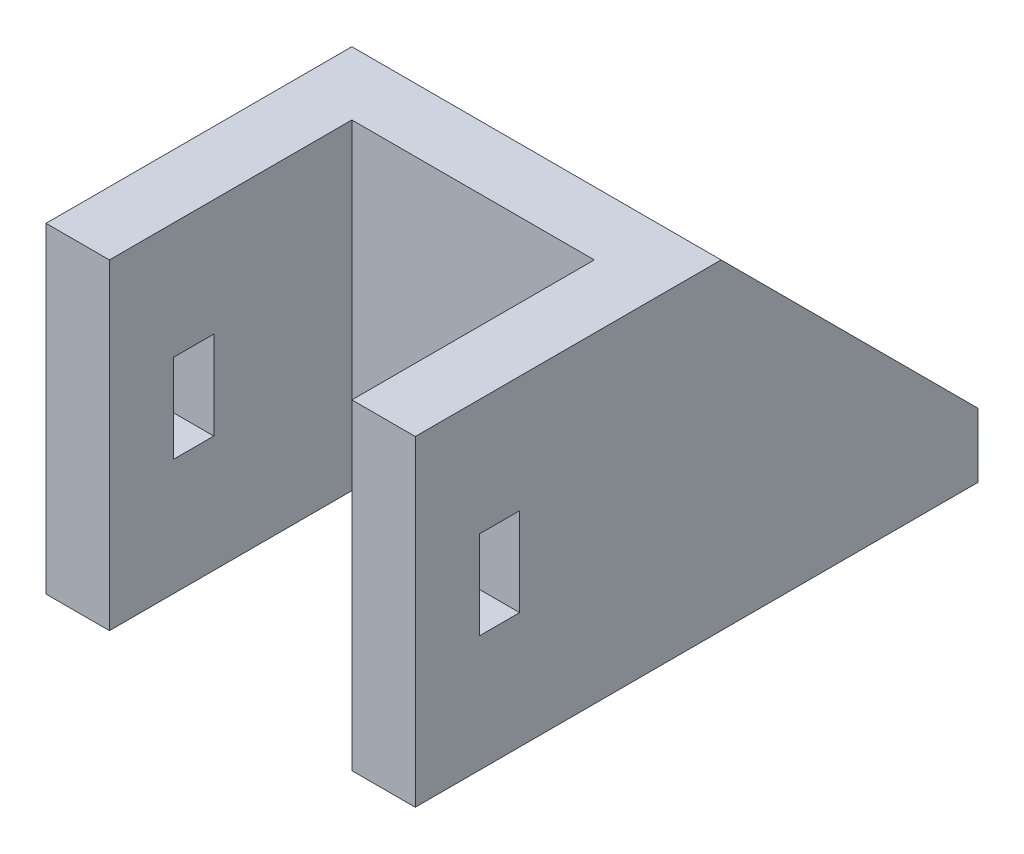
ISO-10303-21;
HEADER;
FILE_DESCRIPTION(('STEP AP214'),'2;1');
FILE_NAME('part.step','',(''),(''),'','','');
FILE_SCHEMA(('AUTOMOTIVE_DESIGN { 1 0 10303 214 1 1 1 1 }'));
ENDSEC;
DATA;
#1=APPLICATION_CONTEXT('core data for automotive mechanical design processes');
#2=APPLICATION_PROTOCOL_DEFINITION('international standard','automotive_design',2000,#1);
#3=PRODUCT_CONTEXT('',#1,'mechanical');
#4=PRODUCT('Part','Part','',(#3));
#5=PRODUCT_RELATED_PRODUCT_CATEGORY('part','',(#4));
#6=PRODUCT_DEFINITION_FORMATION('','',#4);
#7=PRODUCT_DEFINITION_CONTEXT('part definition',#1,'design');
#8=PRODUCT_DEFINITION('design','',#6,#7);
#9=PRODUCT_DEFINITION_SHAPE('','',#8);
#10=(LENGTH_UNIT() NAMED_UNIT(*) SI_UNIT(.MILLI.,.METRE.));
#11=(NAMED_UNIT(*) PLANE_ANGLE_UNIT() SI_UNIT($,.RADIAN.));
#12=(NAMED_UNIT(*) SI_UNIT($,.STERADIAN.) SOLID_ANGLE_UNIT());
#13=UNCERTAINTY_MEASURE_WITH_UNIT(LENGTH_MEASURE(1.E-05),#10,'distance_accuracy_value','');
#14=(GEOMETRIC_REPRESENTATION_CONTEXT(3) GLOBAL_UNCERTAINTY_ASSIGNED_CONTEXT((#13)) GLOBAL_UNIT_ASSIGNED_CONTEXT((#10,
#11,#12)) REPRESENTATION_CONTEXT('',''));
#15=CARTESIAN_POINT('',(0.,0.,0.));
#16=DIRECTION('',(0.,0.,1.));
#17=DIRECTION('',(1.,0.,0.));
#18=AXIS2_PLACEMENT_3D('',#15,#16,#17);
#19=CARTESIAN_POINT('',(-0.794036697247724,4.,-11.1467889908256));
#20=DIRECTION('',(0.,0.,1.));
#21=DIRECTION('',(1.,0.,0.));
#22=AXIS2_PLACEMENT_3D('',#19,#20,#21);
#23=PLANE('',#22);
#24=DIRECTION('',(0.,1.,0.));
#25=VECTOR('',#24,1.);
#26=CARTESIAN_POINT('',(-4.79403669724772,4.,-11.1467889908256));
#27=LINE('',#26,#25);
#28=CARTESIAN_POINT('',(-4.79403669724772,4.,-11.1467889908256));
#29=VERTEX_POINT('',#28);
#30=CARTESIAN_POINT('',(-4.79403669724772,20.,-11.1467889908256));
#31=VERTEX_POINT('',#30);
#32=EDGE_CURVE('E97',#29,#31,#27,.T.);
#33=ORIENTED_EDGE('',*,*,#32,.F.);
#34=DIRECTION('',(-1.,0.,0.));
#35=VECTOR('',#34,1.);
#36=CARTESIAN_POINT('',(-0.794036697247724,4.,-11.1467889908256));
#37=LINE('',#36,#35);
#38=CARTESIAN_POINT('',(-0.794036697247724,4.,-11.1467889908256));
#39=VERTEX_POINT('',#38);
#40=EDGE_CURVE('E12',#39,#29,#37,.T.);
#41=ORIENTED_EDGE('',*,*,#40,.F.);
#42=DIRECTION('',(0.,1.,0.));
#43=VECTOR('',#42,1.);
#44=CARTESIAN_POINT('',(-0.794036697247724,4.,-11.1467889908256));
#45=LINE('',#44,#43);
#46=CARTESIAN_POINT('',(-0.794036697247724,20.,-11.1467889908256));
#47=VERTEX_POINT('',#46);
#48=EDGE_CURVE('E89',#39,#47,#45,.T.);
#49=ORIENTED_EDGE('',*,*,#48,.T.);
#50=DIRECTION('',(-1.,0.,0.));
#51=VECTOR('',#50,1.);
#52=CARTESIAN_POINT('',(-0.794036697247724,20.,-11.1467889908256));
#53=LINE('',#52,#51);
#54=EDGE_CURVE('E48',#47,#31,#53,.T.);
#55=ORIENTED_EDGE('',*,*,#54,.T.);
#56=EDGE_LOOP('',(#33,#41,#49,#55));
#57=FACE_BOUND('',#56,.T.);
#58=ADVANCED_FACE('F45',(#57),#23,.T.);
#59=CARTESIAN_POINT('',(-0.794036697247724,4.,-27.1467889908256));
#60=DIRECTION('',(0.,-1.,0.));
#61=DIRECTION('',(0.,0.,-1.));
#62=AXIS2_PLACEMENT_3D('',#59,#60,#61);
#63=PLANE('',#62);
#64=DIRECTION('',(0.,0.,1.));
#65=VECTOR('',#64,1.);
#66=CARTESIAN_POINT('',(-4.79403669724772,4.,-27.1467889908256));
#67=LINE('',#66,#65);
#68=CARTESIAN_POINT('',(-4.79403669724772,4.,-27.1467889908256));
#69=VERTEX_POINT('',#68);
#70=EDGE_CURVE('E91',#69,#29,#67,.T.);
#71=ORIENTED_EDGE('',*,*,#70,.F.);
#72=DIRECTION('',(-1.,0.,0.));
#73=VECTOR('',#72,1.);
#74=CARTESIAN_POINT('',(-0.794036697247724,4.,-27.1467889908256));
#75=LINE('',#74,#73);
#76=CARTESIAN_POINT('',(-0.794036697247724,4.,-27.1467889908256));
#77=VERTEX_POINT('',#76);
#78=EDGE_CURVE('E54',#77,#69,#75,.T.);
#79=ORIENTED_EDGE('',*,*,#78,.F.);
#80=DIRECTION('',(0.,0.,1.));
#81=VECTOR('',#80,1.);
#82=CARTESIAN_POINT('',(-0.794036697247724,4.,-27.1467889908256));
#83=LINE('',#82,#81);
#84=EDGE_CURVE('E86',#77,#39,#83,.T.);
#85=ORIENTED_EDGE('',*,*,#84,.T.);
#86=ORIENTED_EDGE('',*,*,#40,.T.);
#87=EDGE_LOOP('',(#71,#79,#85,#86));
#88=FACE_BOUND('',#87,.T.);
#89=ADVANCED_FACE('F101',(#88),#63,.T.);
#90=CARTESIAN_POINT('',(-0.794036697247724,20.,-11.1467889908256));
#91=DIRECTION('',(0.,0.707106781186547,-0.707106781186547));
#92=DIRECTION('',(0.,0.707106781186548,0.707106781186548));
#93=AXIS2_PLACEMENT_3D('',#90,#91,#92);
#94=PLANE('',#93);
#95=DIRECTION('',(0.,-0.707106781186548,-0.707106781186548));
#96=VECTOR('',#95,1.);
#97=CARTESIAN_POINT('',(-4.79403669724772,20.,-11.1467889908256));
#98=LINE('',#97,#96);
#99=EDGE_CURVE('E84',#31,#69,#98,.T.);
#100=ORIENTED_EDGE('',*,*,#99,.F.);
#101=ORIENTED_EDGE('',*,*,#54,.F.);
#102=DIRECTION('',(0.,-0.707106781186548,-0.707106781186548));
#103=VECTOR('',#102,1.);
#104=CARTESIAN_POINT('',(-0.794036697247724,20.,-11.1467889908256));
#105=LINE('',#104,#103);
#106=EDGE_CURVE('E82',#47,#77,#105,.T.);
#107=ORIENTED_EDGE('',*,*,#106,.T.);
#108=ORIENTED_EDGE('',*,*,#78,.T.);
#109=EDGE_LOOP('',(#100,#101,#107,#108));
#110=FACE_BOUND('',#109,.T.);
#111=ADVANCED_FACE('F81',(#110),#94,.T.);
#112=CARTESIAN_POINT('',(-0.794036697247724,0.,0.));
#113=DIRECTION('',(1.,0.,0.));
#114=DIRECTION('',(0.,0.,-1.));
#115=AXIS2_PLACEMENT_3D('',#112,#113,#114);
#116=PLANE('',#115);
#117=ORIENTED_EDGE('',*,*,#48,.F.);
#118=ORIENTED_EDGE('',*,*,#84,.F.);
#119=ORIENTED_EDGE('',*,*,#106,.F.);
#120=EDGE_LOOP('',(#117,#118,#119));
#121=FACE_BOUND('',#120,.T.);
#122=ADVANCED_FACE('F88',(#121),#116,.T.);
#123=CARTESIAN_POINT('',(-4.79403669724772,0.,0.));
#124=DIRECTION('',(1.,0.,0.));
#125=DIRECTION('',(0.,0.,-1.));
#126=AXIS2_PLACEMENT_3D('',#123,#124,#125);
#127=PLANE('',#126);
#128=ORIENTED_EDGE('',*,*,#32,.T.);
#129=ORIENTED_EDGE('',*,*,#99,.T.);
#130=ORIENTED_EDGE('',*,*,#70,.T.);
#131=EDGE_LOOP('',(#128,#129,#130));
#132=FACE_BOUND('',#131,.T.);
#133=ADVANCED_FACE('F100',(#132),#127,.F.);
#134=CLOSED_SHELL('',(#58,#89,#111,#122,#133));
#135=MANIFOLD_SOLID_BREP('B2',#134);
#136=CARTESIAN_POINT('',(0.,4.,0.));
#137=DIRECTION('',(0.,-1.,0.));
#138=DIRECTION('',(0.,0.,-1.));
#139=AXIS2_PLACEMENT_3D('',#136,#137,#138);
#140=PLANE('',#139);
#141=DIRECTION('',(0.,0.,-1.));
#142=VECTOR('',#141,1.);
#143=CARTESIAN_POINT('',(14.2059633027523,4.,-11.1467889908256));
#144=LINE('',#143,#142);
#145=CARTESIAN_POINT('',(14.2059633027523,4.,-11.1467889908256));
#146=VERTEX_POINT('',#145);
#147=CARTESIAN_POINT('',(14.2059633027523,4.,-27.1467889908256));
#148=VERTEX_POINT('',#147);
#149=EDGE_CURVE('E349',#146,#148,#144,.T.);
#150=ORIENTED_EDGE('',*,*,#149,.T.);
#151=DIRECTION('',(-1.,0.,0.));
#152=VECTOR('',#151,1.);
#153=CARTESIAN_POINT('',(-4.79403669724772,4.,-27.1467889908256));
#154=LINE('',#153,#152);
#155=CARTESIAN_POINT('',(-4.79403669724772,4.,-27.1467889908256));
#156=VERTEX_POINT('',#155);
#157=EDGE_CURVE('E388',#148,#156,#154,.T.);
#158=ORIENTED_EDGE('',*,*,#157,.T.);
#159=DIRECTION('',(0.,0.,1.));
#160=VECTOR('',#159,1.);
#161=CARTESIAN_POINT('',(-4.79403669724772,4.,-27.1467889908256));
#162=LINE('',#161,#160);
#163=CARTESIAN_POINT('',(-4.79403669724772,4.,-11.1467889908256));
#164=VERTEX_POINT('',#163);
#165=EDGE_CURVE('E385',#156,#164,#162,.T.);
#166=ORIENTED_EDGE('',*,*,#165,.T.);
#167=DIRECTION('',(-1.,0.,0.));
#168=VECTOR('',#167,1.);
#169=CARTESIAN_POINT('',(-4.79403669724772,4.,-11.1467889908256));
#170=LINE('',#169,#168);
#171=EDGE_CURVE('E352',#146,#164,#170,.T.);
#172=ORIENTED_EDGE('',*,*,#171,.F.);
#173=EDGE_LOOP('',(#150,#158,#166,#172));
#174=FACE_BOUND('',#173,.T.);
#175=ADVANCED_FACE('F143',(#174),#140,.F.);
#176=CARTESIAN_POINT('',(-4.79403669724772,20.,-11.1467889908256));
#177=DIRECTION('',(0.,0.,1.));
#178=DIRECTION('',(1.,0.,0.));
#179=AXIS2_PLACEMENT_3D('',#176,#177,#178);
#180=PLANE('',#179);
#181=DIRECTION('',(0.,-1.,0.));
#182=VECTOR('',#181,1.);
#183=CARTESIAN_POINT('',(14.2059633027523,20.,-11.1467889908256));
#184=LINE('',#183,#182);
#185=CARTESIAN_POINT('',(14.2059633027523,20.,-11.1467889908256));
#186=VERTEX_POINT('',#185);
#187=EDGE_CURVE('E346',#186,#146,#184,.T.);
#188=ORIENTED_EDGE('',*,*,#187,.T.);
#189=ORIENTED_EDGE('',*,*,#171,.T.);
#190=DIRECTION('',(0.,-1.,0.));
#191=VECTOR('',#190,1.);
#192=CARTESIAN_POINT('',(-4.79403669724772,20.,-11.1467889908256));
#193=LINE('',#192,#191);
#194=CARTESIAN_POINT('',(-4.79403669724772,20.,-11.1467889908256));
#195=VERTEX_POINT('',#194);
#196=EDGE_CURVE('E380',#195,#164,#193,.T.);
#197=ORIENTED_EDGE('',*,*,#196,.F.);
#198=DIRECTION('',(-1.,0.,0.));
#199=VECTOR('',#198,1.);
#200=CARTESIAN_POINT('',(18.2059633027523,20.,-11.1467889908256));
#201=LINE('',#200,#199);
#202=EDGE_CURVE('E376',#186,#195,#201,.T.);
#203=ORIENTED_EDGE('',*,*,#202,.F.);
#204=EDGE_LOOP('',(#188,#189,#197,#203));
#205=FACE_BOUND('',#204,.T.);
#206=ADVANCED_FACE('F462',(#205),#180,.F.);
#207=CARTESIAN_POINT('',(-4.79403669724772,4.,-11.1467889908256));
#208=DIRECTION('',(1.,0.,0.));
#209=DIRECTION('',(0.,0.,-1.));
#210=AXIS2_PLACEMENT_3D('',#207,#208,#209);
#211=PLANE('',#210);
#212=DIRECTION('',(0.,0.,1.));
#213=VECTOR('',#212,1.);
#214=CARTESIAN_POINT('',(-4.79403669724772,12.75,-11.1467889908256));
#215=LINE('',#214,#213);
#216=CARTESIAN_POINT('',(-4.79403669724772,12.75,1.40321100917436));
#217=VERTEX_POINT('',#216);
#218=CARTESIAN_POINT('',(-4.79403669724772,12.75,3.90321100917436));
#219=VERTEX_POINT('',#218);
#220=EDGE_CURVE('E331',#217,#219,#215,.T.);
#221=ORIENTED_EDGE('',*,*,#220,.T.);
#222=DIRECTION('',(0.,-1.,0.));
#223=VECTOR('',#222,1.);
#224=CARTESIAN_POINT('',(-4.79403669724772,4.,3.90321100917435));
#225=LINE('',#224,#223);
#226=CARTESIAN_POINT('',(-4.79403669724772,7.25,3.90321100917435));
#227=VERTEX_POINT('',#226);
#228=EDGE_CURVE('E340',#219,#227,#225,.T.);
#229=ORIENTED_EDGE('',*,*,#228,.T.);
#230=DIRECTION('',(0.,0.,-1.));
#231=VECTOR('',#230,1.);
#232=CARTESIAN_POINT('',(-4.79403669724772,7.25,-11.1467889908256));
#233=LINE('',#232,#231);
#234=CARTESIAN_POINT('',(-4.79403669724772,7.25,1.40321100917435));
#235=VERTEX_POINT('',#234);
#236=EDGE_CURVE('E315',#227,#235,#233,.T.);
#237=ORIENTED_EDGE('',*,*,#236,.T.);
#238=DIRECTION('',(0.,1.,0.));
#239=VECTOR('',#238,1.);
#240=CARTESIAN_POINT('',(-4.79403669724772,4.,1.40321100917435));
#241=LINE('',#240,#239);
#242=EDGE_CURVE('E322',#235,#217,#241,.T.);
#243=ORIENTED_EDGE('',*,*,#242,.T.);
#244=EDGE_LOOP('',(#221,#229,#237,#243));
#245=FACE_BOUND('',#244,.T.);
#246=DIRECTION('',(0.,0.,1.));
#247=VECTOR('',#246,1.);
#248=CARTESIAN_POINT('',(-4.79403669724772,0.,-11.1467889908256));
#249=LINE('',#248,#247);
#250=CARTESIAN_POINT('',(-4.79403669724772,0.,-27.1467889908256));
#251=VERTEX_POINT('',#250);
#252=CARTESIAN_POINT('',(-4.79403669724772,0.,7.90321100917435));
#253=VERTEX_POINT('',#252);
#254=EDGE_CURVE('E384',#251,#253,#249,.T.);
#255=ORIENTED_EDGE('',*,*,#254,.T.);
#256=DIRECTION('',(0.,-1.,0.));
#257=VECTOR('',#256,1.);
#258=CARTESIAN_POINT('',(-4.79403669724772,4.,7.90321100917435));
#259=LINE('',#258,#257);
#260=CARTESIAN_POINT('',(-4.79403669724772,20.,7.90321100917435));
#261=VERTEX_POINT('',#260);
#262=EDGE_CURVE('E43',#261,#253,#259,.T.);
#263=ORIENTED_EDGE('',*,*,#262,.F.);
#264=DIRECTION('',(0.,0.,1.));
#265=VECTOR('',#264,1.);
#266=CARTESIAN_POINT('',(-4.79403669724772,20.,-11.1467889908256));
#267=LINE('',#266,#265);
#268=EDGE_CURVE('E355',#195,#261,#267,.T.);
#269=ORIENTED_EDGE('',*,*,#268,.F.);
#270=ORIENTED_EDGE('',*,*,#196,.T.);
#271=ORIENTED_EDGE('',*,*,#165,.F.);
#272=DIRECTION('',(0.,-1.,0.));
#273=VECTOR('',#272,1.);
#274=CARTESIAN_POINT('',(-4.79403669724772,4.,-27.1467889908256));
#275=LINE('',#274,#273);
#276=EDGE_CURVE('E392',#156,#251,#275,.T.);
#277=ORIENTED_EDGE('',*,*,#276,.T.);
#278=EDGE_LOOP('',(#255,#263,#269,#270,#271,#277));
#279=FACE_BOUND('',#278,.T.);
#280=ADVANCED_FACE('F145',(#245,#279),#211,.F.);
#281=CARTESIAN_POINT('',(-0.844036697247721,4.,7.90321100917435));
#282=DIRECTION('',(0.,0.,-1.));
#283=DIRECTION('',(-1.,0.,0.));
#284=AXIS2_PLACEMENT_3D('',#281,#282,#283);
#285=PLANE('',#284);
#286=DIRECTION('',(1.,0.,0.));
#287=VECTOR('',#286,1.);
#288=CARTESIAN_POINT('',(-0.844036697247721,0.,7.90321100917435));
#289=LINE('',#288,#287);
#290=CARTESIAN_POINT('',(-0.844036697247721,0.,7.90321100917435));
#291=VERTEX_POINT('',#290);
#292=EDGE_CURVE('E394',#253,#291,#289,.T.);
#293=ORIENTED_EDGE('',*,*,#292,.T.);
#294=DIRECTION('',(0.,-1.,0.));
#295=VECTOR('',#294,1.);
#296=CARTESIAN_POINT('',(-0.844036697247721,4.,7.90321100917435));
#297=LINE('',#296,#295);
#298=CARTESIAN_POINT('',(-0.844036697247721,20.,7.90321100917435));
#299=VERTEX_POINT('',#298);
#300=EDGE_CURVE('E151',#299,#291,#297,.T.);
#301=ORIENTED_EDGE('',*,*,#300,.F.);
#302=DIRECTION('',(1.,0.,0.));
#303=VECTOR('',#302,1.);
#304=CARTESIAN_POINT('',(-4.79403669724772,20.,7.90321100917435));
#305=LINE('',#304,#303);
#306=EDGE_CURVE('E358',#261,#299,#305,.T.);
#307=ORIENTED_EDGE('',*,*,#306,.F.);
#308=ORIENTED_EDGE('',*,*,#262,.T.);
#309=EDGE_LOOP('',(#293,#301,#307,#308));
#310=FACE_BOUND('',#309,.T.);
#311=ADVANCED_FACE('F466',(#310),#285,.F.);
#312=CARTESIAN_POINT('',(-0.844036697247723,4.,-7.19678899082565));
#313=DIRECTION('',(-1.,0.,0.));
#314=DIRECTION('',(0.,0.,1.));
#315=AXIS2_PLACEMENT_3D('',#312,#313,#314);
#316=PLANE('',#315);
#317=DIRECTION('',(0.,0.,1.));
#318=VECTOR('',#317,1.);
#319=CARTESIAN_POINT('',(-0.844036697247723,7.25,-7.19678899082565));
#320=LINE('',#319,#318);
#321=CARTESIAN_POINT('',(-0.844036697247721,7.25,1.40321100917435));
#322=VERTEX_POINT('',#321);
#323=CARTESIAN_POINT('',(-0.844036697247721,7.25,3.90321100917436));
#324=VERTEX_POINT('',#323);
#325=EDGE_CURVE('E312',#322,#324,#320,.T.);
#326=ORIENTED_EDGE('',*,*,#325,.T.);
#327=DIRECTION('',(0.,1.,0.));
#328=VECTOR('',#327,1.);
#329=CARTESIAN_POINT('',(-0.844036697247721,4.,3.90321100917435));
#330=LINE('',#329,#328);
#331=CARTESIAN_POINT('',(-0.844036697247721,12.75,3.90321100917435));
#332=VERTEX_POINT('',#331);
#333=EDGE_CURVE('E337',#324,#332,#330,.T.);
#334=ORIENTED_EDGE('',*,*,#333,.T.);
#335=DIRECTION('',(0.,0.,-1.));
#336=VECTOR('',#335,1.);
#337=CARTESIAN_POINT('',(-0.844036697247723,12.75,-7.19678899082565));
#338=LINE('',#337,#336);
#339=CARTESIAN_POINT('',(-0.844036697247722,12.75,1.40321100917435));
#340=VERTEX_POINT('',#339);
#341=EDGE_CURVE('E328',#332,#340,#338,.T.);
#342=ORIENTED_EDGE('',*,*,#341,.T.);
#343=DIRECTION('',(0.,-1.,0.));
#344=VECTOR('',#343,1.);
#345=CARTESIAN_POINT('',(-0.844036697247722,4.,1.40321100917435));
#346=LINE('',#345,#344);
#347=EDGE_CURVE('E319',#340,#322,#346,.T.);
#348=ORIENTED_EDGE('',*,*,#347,.T.);
#349=EDGE_LOOP('',(#326,#334,#342,#348));
#350=FACE_BOUND('',#349,.T.);
#351=DIRECTION('',(0.,0.,-1.));
#352=VECTOR('',#351,1.);
#353=CARTESIAN_POINT('',(-0.844036697247723,0.,-7.19678899082565));
#354=LINE('',#353,#352);
#355=CARTESIAN_POINT('',(-0.844036697247723,0.,-7.19678899082565));
#356=VERTEX_POINT('',#355);
#357=EDGE_CURVE('E396',#291,#356,#354,.T.);
#358=ORIENTED_EDGE('',*,*,#357,.T.);
#359=DIRECTION('',(0.,-1.,0.));
#360=VECTOR('',#359,1.);
#361=CARTESIAN_POINT('',(-0.844036697247723,4.,-7.19678899082565));
#362=LINE('',#361,#360);
#363=CARTESIAN_POINT('',(-0.844036697247723,20.,-7.19678899082565));
#364=VERTEX_POINT('',#363);
#365=EDGE_CURVE('E423',#364,#356,#362,.T.);
#366=ORIENTED_EDGE('',*,*,#365,.F.);
#367=DIRECTION('',(0.,0.,-1.));
#368=VECTOR('',#367,1.);
#369=CARTESIAN_POINT('',(-0.844036697247723,20.,-7.19678899082565));
#370=LINE('',#369,#368);
#371=EDGE_CURVE('E361',#299,#364,#370,.T.);
#372=ORIENTED_EDGE('',*,*,#371,.F.);
#373=ORIENTED_EDGE('',*,*,#300,.T.);
#374=EDGE_LOOP('',(#358,#366,#372,#373));
#375=FACE_BOUND('',#374,.T.);
#376=ADVANCED_FACE('F429',(#350,#375),#316,.F.);
#377=CARTESIAN_POINT('',(-0.844036697247723,4.,-7.19678899082565));
#378=DIRECTION('',(0.,0.,-1.));
#379=DIRECTION('',(-1.,0.,0.));
#380=AXIS2_PLACEMENT_3D('',#377,#378,#379);
#381=PLANE('',#380);
#382=DIRECTION('',(1.,0.,0.));
#383=VECTOR('',#382,1.);
#384=CARTESIAN_POINT('',(-0.844036697247723,0.,-7.19678899082565));
#385=LINE('',#384,#383);
#386=CARTESIAN_POINT('',(14.2559633027523,0.,-7.19678899082565));
#387=VERTEX_POINT('',#386);
#388=EDGE_CURVE('E398',#356,#387,#385,.T.);
#389=ORIENTED_EDGE('',*,*,#388,.T.);
#390=DIRECTION('',(0.,-1.,0.));
#391=VECTOR('',#390,1.);
#392=CARTESIAN_POINT('',(14.2559633027523,4.,-7.19678899082565));
#393=LINE('',#392,#391);
#394=CARTESIAN_POINT('',(14.2559633027523,20.,-7.19678899082565));
#395=VERTEX_POINT('',#394);
#396=EDGE_CURVE('E420',#395,#387,#393,.T.);
#397=ORIENTED_EDGE('',*,*,#396,.F.);
#398=DIRECTION('',(1.,0.,0.));
#399=VECTOR('',#398,1.);
#400=CARTESIAN_POINT('',(14.2559633027523,20.,-7.19678899082565));
#401=LINE('',#400,#399);
#402=EDGE_CURVE('E364',#364,#395,#401,.T.);
#403=ORIENTED_EDGE('',*,*,#402,.F.);
#404=ORIENTED_EDGE('',*,*,#365,.T.);
#405=EDGE_LOOP('',(#389,#397,#403,#404));
#406=FACE_BOUND('',#405,.T.);
#407=ADVANCED_FACE('F439',(#406),#381,.F.);
#408=CARTESIAN_POINT('',(14.2559633027523,4.,-7.19678899082565));
#409=DIRECTION('',(1.,0.,0.));
#410=DIRECTION('',(0.,0.,-1.));
#411=AXIS2_PLACEMENT_3D('',#408,#409,#410);
#412=PLANE('',#411);
#413=DIRECTION('',(0.,0.,1.));
#414=VECTOR('',#413,1.);
#415=CARTESIAN_POINT('',(14.2559633027523,12.75,-7.19678899082565));
#416=LINE('',#415,#414);
#417=CARTESIAN_POINT('',(14.2559633027523,12.75,1.40321100917435));
#418=VERTEX_POINT('',#417);
#419=CARTESIAN_POINT('',(14.2559633027523,12.75,3.90321100917435));
#420=VERTEX_POINT('',#419);
#421=EDGE_CURVE('E325',#418,#420,#416,.T.);
#422=ORIENTED_EDGE('',*,*,#421,.T.);
#423=DIRECTION('',(0.,-1.,0.));
#424=VECTOR('',#423,1.);
#425=CARTESIAN_POINT('',(14.2559633027523,4.,3.90321100917435));
#426=LINE('',#425,#424);
#427=CARTESIAN_POINT('',(14.2559633027523,7.25,3.90321100917435));
#428=VERTEX_POINT('',#427);
#429=EDGE_CURVE('E334',#420,#428,#426,.T.);
#430=ORIENTED_EDGE('',*,*,#429,.T.);
#431=DIRECTION('',(0.,0.,-1.));
#432=VECTOR('',#431,1.);
#433=CARTESIAN_POINT('',(14.2559633027523,7.25,-7.19678899082565));
#434=LINE('',#433,#432);
#435=CARTESIAN_POINT('',(14.2559633027523,7.25,1.40321100917435));
#436=VERTEX_POINT('',#435);
#437=EDGE_CURVE('E310',#428,#436,#434,.T.);
#438=ORIENTED_EDGE('',*,*,#437,.T.);
#439=DIRECTION('',(0.,1.,0.));
#440=VECTOR('',#439,1.);
#441=CARTESIAN_POINT('',(14.2559633027523,4.,1.40321100917435));
#442=LINE('',#441,#440);
#443=EDGE_CURVE('E281',#436,#418,#442,.T.);
#444=ORIENTED_EDGE('',*,*,#443,.T.);
#445=EDGE_LOOP('',(#422,#430,#438,#444));
#446=FACE_BOUND('',#445,.T.);
#447=DIRECTION('',(0.,0.,1.));
#448=VECTOR('',#447,1.);
#449=CARTESIAN_POINT('',(14.2559633027523,0.,-7.19678899082565));
#450=LINE('',#449,#448);
#451=CARTESIAN_POINT('',(14.2559633027523,0.,7.90321100917435));
#452=VERTEX_POINT('',#451);
#453=EDGE_CURVE('E400',#387,#452,#450,.T.);
#454=ORIENTED_EDGE('',*,*,#453,.T.);
#455=DIRECTION('',(0.,-1.,0.));
#456=VECTOR('',#455,1.);
#457=CARTESIAN_POINT('',(14.2559633027523,4.,7.90321100917435));
#458=LINE('',#457,#456);
#459=CARTESIAN_POINT('',(14.2559633027523,20.,7.90321100917435));
#460=VERTEX_POINT('',#459);
#461=EDGE_CURVE('E417',#460,#452,#458,.T.);
#462=ORIENTED_EDGE('',*,*,#461,.F.);
#463=DIRECTION('',(0.,0.,1.));
#464=VECTOR('',#463,1.);
#465=CARTESIAN_POINT('',(14.2559633027523,20.,-7.19678899082565));
#466=LINE('',#465,#464);
#467=EDGE_CURVE('E367',#395,#460,#466,.T.);
#468=ORIENTED_EDGE('',*,*,#467,.F.);
#469=ORIENTED_EDGE('',*,*,#396,.T.);
#470=EDGE_LOOP('',(#454,#462,#468,#469));
#471=FACE_BOUND('',#470,.T.);
#472=ADVANCED_FACE('F443',(#446,#471),#412,.F.);
#473=CARTESIAN_POINT('',(14.2559633027523,4.,7.90321100917435));
#474=DIRECTION('',(0.,0.,-1.));
#475=DIRECTION('',(-1.,0.,0.));
#476=AXIS2_PLACEMENT_3D('',#473,#474,#475);
#477=PLANE('',#476);
#478=DIRECTION('',(1.,0.,0.));
#479=VECTOR('',#478,1.);
#480=CARTESIAN_POINT('',(14.2559633027523,0.,7.90321100917435));
#481=LINE('',#480,#479);
#482=CARTESIAN_POINT('',(18.2059633027523,0.,7.90321100917435));
#483=VERTEX_POINT('',#482);
#484=EDGE_CURVE('E402',#452,#483,#481,.T.);
#485=ORIENTED_EDGE('',*,*,#484,.T.);
#486=DIRECTION('',(0.,-1.,0.));
#487=VECTOR('',#486,1.);
#488=CARTESIAN_POINT('',(18.2059633027523,4.,7.90321100917435));
#489=LINE('',#488,#487);
#490=CARTESIAN_POINT('',(18.2059633027523,20.,7.90321100917435));
#491=VERTEX_POINT('',#490);
#492=EDGE_CURVE('E414',#491,#483,#489,.T.);
#493=ORIENTED_EDGE('',*,*,#492,.F.);
#494=DIRECTION('',(1.,0.,0.));
#495=VECTOR('',#494,1.);
#496=CARTESIAN_POINT('',(18.2059633027523,20.,7.90321100917435));
#497=LINE('',#496,#495);
#498=EDGE_CURVE('E370',#460,#491,#497,.T.);
#499=ORIENTED_EDGE('',*,*,#498,.F.);
#500=ORIENTED_EDGE('',*,*,#461,.T.);
#501=EDGE_LOOP('',(#485,#493,#499,#500));
#502=FACE_BOUND('',#501,.T.);
#503=ADVANCED_FACE('F449',(#502),#477,.F.);
#504=CARTESIAN_POINT('',(18.2059633027523,4.,-27.1467889908256));
#505=DIRECTION('',(-1.,0.,0.));
#506=DIRECTION('',(0.,0.,1.));
#507=AXIS2_PLACEMENT_3D('',#504,#505,#506);
#508=PLANE('',#507);
#509=DIRECTION('',(0.,0.,-1.));
#510=VECTOR('',#509,1.);
#511=CARTESIAN_POINT('',(18.2059633027523,7.25,3.90321100917435));
#512=LINE('',#511,#510);
#513=CARTESIAN_POINT('',(18.2059633027523,7.25,3.90321100917436));
#514=VERTEX_POINT('',#513);
#515=CARTESIAN_POINT('',(18.2059633027523,7.25,1.40321100917435));
#516=VERTEX_POINT('',#515);
#517=EDGE_CURVE('E287',#514,#516,#512,.T.);
#518=ORIENTED_EDGE('',*,*,#517,.F.);
#519=DIRECTION('',(0.,-1.,0.));
#520=VECTOR('',#519,1.);
#521=CARTESIAN_POINT('',(18.2059633027523,12.75,3.90321100917435));
#522=LINE('',#521,#520);
#523=CARTESIAN_POINT('',(18.2059633027523,12.75,3.90321100917435));
#524=VERTEX_POINT('',#523);
#525=EDGE_CURVE('E293',#524,#514,#522,.T.);
#526=ORIENTED_EDGE('',*,*,#525,.F.);
#527=DIRECTION('',(0.,0.,1.));
#528=VECTOR('',#527,1.);
#529=CARTESIAN_POINT('',(18.2059633027523,12.75,3.90321100917435));
#530=LINE('',#529,#528);
#531=CARTESIAN_POINT('',(18.2059633027523,12.75,1.40321100917435));
#532=VERTEX_POINT('',#531);
#533=EDGE_CURVE('E298',#532,#524,#530,.T.);
#534=ORIENTED_EDGE('',*,*,#533,.F.);
#535=DIRECTION('',(0.,1.,0.));
#536=VECTOR('',#535,1.);
#537=CARTESIAN_POINT('',(18.2059633027523,12.75,1.40321100917435));
#538=LINE('',#537,#536);
#539=EDGE_CURVE('E278',#516,#532,#538,.T.);
#540=ORIENTED_EDGE('',*,*,#539,.F.);
#541=EDGE_LOOP('',(#518,#526,#534,#540));
#542=FACE_BOUND('',#541,.T.);
#543=DIRECTION('',(0.,-1.,0.));
#544=VECTOR('',#543,1.);
#545=CARTESIAN_POINT('',(18.2059633027523,4.,-27.1467889908256));
#546=LINE('',#545,#544);
#547=CARTESIAN_POINT('',(18.2059633027523,4.,-27.1467889908256));
#548=VERTEX_POINT('',#547);
#549=CARTESIAN_POINT('',(18.2059633027523,0.,-27.1467889908256));
#550=VERTEX_POINT('',#549);
#551=EDGE_CURVE('E411',#548,#550,#546,.T.);
#552=ORIENTED_EDGE('',*,*,#551,.F.);
#553=DIRECTION('',(0.,0.707106781186548,0.707106781186548));
#554=VECTOR('',#553,1.);
#555=CARTESIAN_POINT('',(18.2059633027523,4.,-27.1467889908256));
#556=LINE('',#555,#554);
#557=CARTESIAN_POINT('',(18.2059633027523,20.,-11.1467889908256));
#558=VERTEX_POINT('',#557);
#559=EDGE_CURVE('E343',#548,#558,#556,.T.);
#560=ORIENTED_EDGE('',*,*,#559,.T.);
#561=DIRECTION('',(0.,0.,-1.));
#562=VECTOR('',#561,1.);
#563=CARTESIAN_POINT('',(18.2059633027523,20.,-11.1467889908256));
#564=LINE('',#563,#562);
#565=EDGE_CURVE('E373',#491,#558,#564,.T.);
#566=ORIENTED_EDGE('',*,*,#565,.F.);
#567=ORIENTED_EDGE('',*,*,#492,.T.);
#568=DIRECTION('',(0.,0.,-1.));
#569=VECTOR('',#568,1.);
#570=CARTESIAN_POINT('',(18.2059633027523,0.,-27.1467889908256));
#571=LINE('',#570,#569);
#572=EDGE_CURVE('E405',#483,#550,#571,.T.);
#573=ORIENTED_EDGE('',*,*,#572,.T.);
#574=EDGE_LOOP('',(#552,#560,#566,#567,#573));
#575=FACE_BOUND('',#574,.T.);
#576=ADVANCED_FACE('F295',(#542,#575),#508,.F.);
#577=CARTESIAN_POINT('',(-4.79403669724772,4.,-27.1467889908256));
#578=DIRECTION('',(0.,0.,1.));
#579=DIRECTION('',(1.,0.,0.));
#580=AXIS2_PLACEMENT_3D('',#577,#578,#579);
#581=PLANE('',#580);
#582=DIRECTION('',(-1.,0.,0.));
#583=VECTOR('',#582,1.);
#584=CARTESIAN_POINT('',(-4.79403669724772,0.,-27.1467889908256));
#585=LINE('',#584,#583);
#586=EDGE_CURVE('E389',#550,#251,#585,.T.);
#587=ORIENTED_EDGE('',*,*,#586,.T.);
#588=ORIENTED_EDGE('',*,*,#276,.F.);
#589=ORIENTED_EDGE('',*,*,#157,.F.);
#590=EDGE_CURVE('E390',#548,#148,#154,.T.);
#591=ORIENTED_EDGE('',*,*,#590,.F.);
#592=ORIENTED_EDGE('',*,*,#551,.T.);
#593=EDGE_LOOP('',(#587,#588,#589,#591,#592));
#594=FACE_BOUND('',#593,.T.);
#595=ADVANCED_FACE('F486',(#594),#581,.F.);
#596=CARTESIAN_POINT('',(0.,0.,0.));
#597=DIRECTION('',(0.,-1.,0.));
#598=DIRECTION('',(0.,0.,-1.));
#599=AXIS2_PLACEMENT_3D('',#596,#597,#598);
#600=PLANE('',#599);
#601=ORIENTED_EDGE('',*,*,#254,.F.);
#602=ORIENTED_EDGE('',*,*,#586,.F.);
#603=ORIENTED_EDGE('',*,*,#572,.F.);
#604=ORIENTED_EDGE('',*,*,#484,.F.);
#605=ORIENTED_EDGE('',*,*,#453,.F.);
#606=ORIENTED_EDGE('',*,*,#388,.F.);
#607=ORIENTED_EDGE('',*,*,#357,.F.);
#608=ORIENTED_EDGE('',*,*,#292,.F.);
#609=EDGE_LOOP('',(#601,#602,#603,#604,#605,#606,#607,#608));
#610=FACE_BOUND('',#609,.T.);
#611=ADVANCED_FACE('F435',(#610),#600,.T.);
#612=CARTESIAN_POINT('',(0.,20.,0.));
#613=DIRECTION('',(0.,1.,0.));
#614=DIRECTION('',(0.,0.,1.));
#615=AXIS2_PLACEMENT_3D('',#612,#613,#614);
#616=PLANE('',#615);
#617=ORIENTED_EDGE('',*,*,#268,.T.);
#618=ORIENTED_EDGE('',*,*,#306,.T.);
#619=ORIENTED_EDGE('',*,*,#371,.T.);
#620=ORIENTED_EDGE('',*,*,#402,.T.);
#621=ORIENTED_EDGE('',*,*,#467,.T.);
#622=ORIENTED_EDGE('',*,*,#498,.T.);
#623=ORIENTED_EDGE('',*,*,#565,.T.);
#624=EDGE_CURVE('E377',#558,#186,#201,.T.);
#625=ORIENTED_EDGE('',*,*,#624,.T.);
#626=ORIENTED_EDGE('',*,*,#202,.T.);
#627=EDGE_LOOP('',(#617,#618,#619,#620,#621,#622,#623,#625,#626));
#628=FACE_BOUND('',#627,.T.);
#629=ADVANCED_FACE('F446',(#628),#616,.T.);
#630=CARTESIAN_POINT('',(14.2059633027523,4.,-27.1467889908256));
#631=DIRECTION('',(0.,0.707106781186547,-0.707106781186547));
#632=DIRECTION('',(0.,0.707106781186548,0.707106781186548));
#633=AXIS2_PLACEMENT_3D('',#630,#631,#632);
#634=PLANE('',#633);
#635=ORIENTED_EDGE('',*,*,#559,.F.);
#636=ORIENTED_EDGE('',*,*,#590,.T.);
#637=DIRECTION('',(0.,0.707106781186548,0.707106781186548));
#638=VECTOR('',#637,1.);
#639=CARTESIAN_POINT('',(14.2059633027523,4.,-27.1467889908256));
#640=LINE('',#639,#638);
#641=EDGE_CURVE('E344',#148,#186,#640,.T.);
#642=ORIENTED_EDGE('',*,*,#641,.T.);
#643=ORIENTED_EDGE('',*,*,#624,.F.);
#644=EDGE_LOOP('',(#635,#636,#642,#643));
#645=FACE_BOUND('',#644,.T.);
#646=ADVANCED_FACE('F454',(#645),#634,.T.);
#647=CARTESIAN_POINT('',(14.2059633027523,0.,0.));
#648=DIRECTION('',(1.,0.,0.));
#649=DIRECTION('',(0.,0.,-1.));
#650=AXIS2_PLACEMENT_3D('',#647,#648,#649);
#651=PLANE('',#650);
#652=ORIENTED_EDGE('',*,*,#641,.F.);
#653=ORIENTED_EDGE('',*,*,#149,.F.);
#654=ORIENTED_EDGE('',*,*,#187,.F.);
#655=EDGE_LOOP('',(#652,#653,#654));
#656=FACE_BOUND('',#655,.T.);
#657=ADVANCED_FACE('F459',(#656),#651,.F.);
#658=CARTESIAN_POINT('',(-13.7940366972477,7.25,3.90321100917436));
#659=DIRECTION('',(0.,-1.,0.));
#660=DIRECTION('',(0.,0.,-1.));
#661=AXIS2_PLACEMENT_3D('',#658,#659,#660);
#662=PLANE('',#661);
#663=DIRECTION('',(1.,0.,0.));
#664=VECTOR('',#663,1.);
#665=CARTESIAN_POINT('',(-13.7940366972477,7.25,3.90321100917436));
#666=LINE('',#665,#664);
#667=EDGE_CURVE('E290',#428,#514,#666,.T.);
#668=ORIENTED_EDGE('',*,*,#667,.T.);
#669=ORIENTED_EDGE('',*,*,#517,.T.);
#670=DIRECTION('',(1.,0.,0.));
#671=VECTOR('',#670,1.);
#672=CARTESIAN_POINT('',(-13.7940366972477,7.25,1.40321100917436));
#673=LINE('',#672,#671);
#674=EDGE_CURVE('E273',#436,#516,#673,.T.);
#675=ORIENTED_EDGE('',*,*,#674,.F.);
#676=ORIENTED_EDGE('',*,*,#437,.F.);
#677=EDGE_LOOP('',(#668,#669,#675,#676));
#678=FACE_BOUND('',#677,.T.);
#679=ADVANCED_FACE('F288',(#678),#662,.F.);
#680=CARTESIAN_POINT('',(-13.7940366972477,12.75,1.40321100917436));
#681=DIRECTION('',(0.,0.,-1.));
#682=DIRECTION('',(-1.,0.,0.));
#683=AXIS2_PLACEMENT_3D('',#680,#681,#682);
#684=PLANE('',#683);
#685=ORIENTED_EDGE('',*,*,#674,.T.);
#686=ORIENTED_EDGE('',*,*,#539,.T.);
#687=DIRECTION('',(1.,0.,0.));
#688=VECTOR('',#687,1.);
#689=CARTESIAN_POINT('',(-13.7940366972477,12.75,1.40321100917436));
#690=LINE('',#689,#688);
#691=EDGE_CURVE('E307',#418,#532,#690,.T.);
#692=ORIENTED_EDGE('',*,*,#691,.F.);
#693=ORIENTED_EDGE('',*,*,#443,.F.);
#694=EDGE_LOOP('',(#685,#686,#692,#693));
#695=FACE_BOUND('',#694,.T.);
#696=ADVANCED_FACE('F275',(#695),#684,.F.);
#697=CARTESIAN_POINT('',(-13.7940366972477,12.75,3.90321100917436));
#698=DIRECTION('',(0.,1.,0.));
#699=DIRECTION('',(0.,0.,1.));
#700=AXIS2_PLACEMENT_3D('',#697,#698,#699);
#701=PLANE('',#700);
#702=ORIENTED_EDGE('',*,*,#691,.T.);
#703=ORIENTED_EDGE('',*,*,#533,.T.);
#704=DIRECTION('',(1.,0.,0.));
#705=VECTOR('',#704,1.);
#706=CARTESIAN_POINT('',(-13.7940366972477,12.75,3.90321100917436));
#707=LINE('',#706,#705);
#708=EDGE_CURVE('E303',#420,#524,#707,.T.);
#709=ORIENTED_EDGE('',*,*,#708,.F.);
#710=ORIENTED_EDGE('',*,*,#421,.F.);
#711=EDGE_LOOP('',(#702,#703,#709,#710));
#712=FACE_BOUND('',#711,.T.);
#713=ADVANCED_FACE('F554',(#712),#701,.F.);
#714=CARTESIAN_POINT('',(-13.7940366972477,12.75,3.90321100917436));
#715=DIRECTION('',(0.,0.,1.));
#716=DIRECTION('',(1.,0.,0.));
#717=AXIS2_PLACEMENT_3D('',#714,#715,#716);
#718=PLANE('',#717);
#719=ORIENTED_EDGE('',*,*,#708,.T.);
#720=ORIENTED_EDGE('',*,*,#525,.T.);
#721=ORIENTED_EDGE('',*,*,#667,.F.);
#722=ORIENTED_EDGE('',*,*,#429,.F.);
#723=EDGE_LOOP('',(#719,#720,#721,#722));
#724=FACE_BOUND('',#723,.T.);
#725=ADVANCED_FACE('F562',(#724),#718,.F.);
#726=EDGE_CURVE('E305',#219,#332,#707,.T.);
#727=ORIENTED_EDGE('',*,*,#726,.T.);
#728=ORIENTED_EDGE('',*,*,#333,.F.);
#729=EDGE_CURVE('E163',#227,#324,#666,.T.);
#730=ORIENTED_EDGE('',*,*,#729,.F.);
#731=ORIENTED_EDGE('',*,*,#228,.F.);
#732=EDGE_LOOP('',(#727,#728,#730,#731));
#733=FACE_BOUND('',#732,.T.);
#734=ADVANCED_FACE('F571',(#733),#718,.F.);
#735=EDGE_CURVE('E306',#217,#340,#690,.T.);
#736=ORIENTED_EDGE('',*,*,#735,.T.);
#737=ORIENTED_EDGE('',*,*,#341,.F.);
#738=ORIENTED_EDGE('',*,*,#726,.F.);
#739=ORIENTED_EDGE('',*,*,#220,.F.);
#740=EDGE_LOOP('',(#736,#737,#738,#739));
#741=FACE_BOUND('',#740,.T.);
#742=ADVANCED_FACE('F565',(#741),#701,.F.);
#743=EDGE_CURVE('E158',#235,#322,#673,.T.);
#744=ORIENTED_EDGE('',*,*,#743,.T.);
#745=ORIENTED_EDGE('',*,*,#347,.F.);
#746=ORIENTED_EDGE('',*,*,#735,.F.);
#747=ORIENTED_EDGE('',*,*,#242,.F.);
#748=EDGE_LOOP('',(#744,#745,#746,#747));
#749=FACE_BOUND('',#748,.T.);
#750=ADVANCED_FACE('F556',(#749),#684,.F.);
#751=ORIENTED_EDGE('',*,*,#729,.T.);
#752=ORIENTED_EDGE('',*,*,#325,.F.);
#753=ORIENTED_EDGE('',*,*,#743,.F.);
#754=ORIENTED_EDGE('',*,*,#236,.F.);
#755=EDGE_LOOP('',(#751,#752,#753,#754));
#756=FACE_BOUND('',#755,.T.);
#757=ADVANCED_FACE('F548',(#756),#662,.F.);
#758=CLOSED_SHELL('',(#175,#206,#280,#311,#376,#407,#472,#503,#576,#595,#611,#629,#646,#657,
#679,#696,#713,#725,#734,#742,#750,#757));
#759=MANIFOLD_SOLID_BREP('B6',#758);
#760=ADVANCED_BREP_SHAPE_REPRESENTATION('',(#18,#135,#759),#14);
#761=SHAPE_DEFINITION_REPRESENTATION(#9,#760);
ENDSEC;
END-ISO-10303-21;
